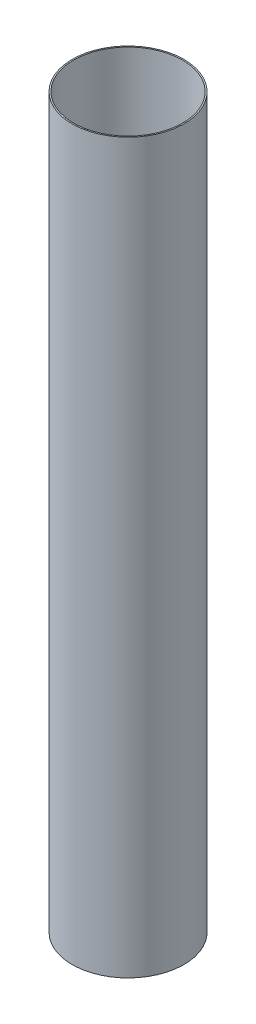
ISO-10303-21;
HEADER;
FILE_DESCRIPTION(('STEP AP214'),'2;1');
FILE_NAME('part.step','',(''),(''),'','','');
FILE_SCHEMA(('AUTOMOTIVE_DESIGN { 1 0 10303 214 1 1 1 1 }'));
ENDSEC;
DATA;
#1=APPLICATION_CONTEXT('core data for automotive mechanical design processes');
#2=APPLICATION_PROTOCOL_DEFINITION('international standard','automotive_design',2000,#1);
#3=PRODUCT_CONTEXT('',#1,'mechanical');
#4=PRODUCT('Part','Part','',(#3));
#5=PRODUCT_RELATED_PRODUCT_CATEGORY('part','',(#4));
#6=PRODUCT_DEFINITION_FORMATION('','',#4);
#7=PRODUCT_DEFINITION_CONTEXT('part definition',#1,'design');
#8=PRODUCT_DEFINITION('design','',#6,#7);
#9=PRODUCT_DEFINITION_SHAPE('','',#8);
#10=(LENGTH_UNIT() NAMED_UNIT(*) SI_UNIT(.MILLI.,.METRE.));
#11=(NAMED_UNIT(*) PLANE_ANGLE_UNIT() SI_UNIT($,.RADIAN.));
#12=(NAMED_UNIT(*) SI_UNIT($,.STERADIAN.) SOLID_ANGLE_UNIT());
#13=UNCERTAINTY_MEASURE_WITH_UNIT(LENGTH_MEASURE(1.E-05),#10,'distance_accuracy_value','');
#14=(GEOMETRIC_REPRESENTATION_CONTEXT(3) GLOBAL_UNCERTAINTY_ASSIGNED_CONTEXT((#13)) GLOBAL_UNIT_ASSIGNED_CONTEXT((#10,
#11,#12)) REPRESENTATION_CONTEXT('',''));
#15=CARTESIAN_POINT('',(0.,0.,0.));
#16=DIRECTION('',(0.,0.,1.));
#17=DIRECTION('',(1.,0.,0.));
#18=AXIS2_PLACEMENT_3D('',#15,#16,#17);
#19=CARTESIAN_POINT('',(0.,-13.97,0.));
#20=DIRECTION('',(0.,-1.,0.));
#21=DIRECTION('',(0.,0.,-1.));
#22=AXIS2_PLACEMENT_3D('',#19,#20,#21);
#23=CYLINDRICAL_SURFACE('',#22,19.0373);
#24=CARTESIAN_POINT('',(0.,0.,0.));
#25=DIRECTION('',(0.,-1.,0.));
#26=DIRECTION('',(0.,0.,-1.));
#27=AXIS2_PLACEMENT_3D('',#24,#25,#26);
#28=CIRCLE('',#27,19.0373);
#29=CARTESIAN_POINT('',(0.,0.,-19.0373));
#30=VERTEX_POINT('',#29);
#31=EDGE_CURVE('E50',#30,#30,#28,.T.);
#32=ORIENTED_EDGE('',*,*,#31,.T.);
#33=EDGE_LOOP('',(#32));
#34=FACE_BOUND('',#33,.T.);
#35=CARTESIAN_POINT('',(0.,254.,0.));
#36=DIRECTION('',(0.,-1.,0.));
#37=DIRECTION('',(0.,0.,-1.));
#38=AXIS2_PLACEMENT_3D('',#35,#36,#37);
#39=CIRCLE('',#38,19.0373);
#40=CARTESIAN_POINT('',(0.,254.,-19.0373));
#41=VERTEX_POINT('',#40);
#42=EDGE_CURVE('E10',#41,#41,#39,.T.);
#43=ORIENTED_EDGE('',*,*,#42,.F.);
#44=EDGE_LOOP('',(#43));
#45=FACE_BOUND('',#44,.T.);
#46=ADVANCED_FACE('F36',(#34,#45),#23,.F.);
#47=CARTESIAN_POINT('',(19.0373,254.,0.));
#48=DIRECTION('',(0.,1.,0.));
#49=DIRECTION('',(0.,0.,1.));
#50=AXIS2_PLACEMENT_3D('',#47,#48,#49);
#51=PLANE('',#50);
#52=ORIENTED_EDGE('',*,*,#42,.T.);
#53=EDGE_LOOP('',(#52));
#54=FACE_BOUND('',#53,.T.);
#55=CARTESIAN_POINT('',(0.,254.,0.));
#56=DIRECTION('',(0.,-1.,0.));
#57=DIRECTION('',(0.,0.,-1.));
#58=AXIS2_PLACEMENT_3D('',#55,#56,#57);
#59=CIRCLE('',#58,19.4945);
#60=CARTESIAN_POINT('',(0.,254.,-19.4945));
#61=VERTEX_POINT('',#60);
#62=EDGE_CURVE('E42',#61,#61,#59,.T.);
#63=ORIENTED_EDGE('',*,*,#62,.F.);
#64=EDGE_LOOP('',(#63));
#65=FACE_BOUND('',#64,.T.);
#66=ADVANCED_FACE('F66',(#54,#65),#51,.T.);
#67=CARTESIAN_POINT('',(0.,-13.97,0.));
#68=DIRECTION('',(0.,-1.,0.));
#69=DIRECTION('',(0.,0.,-1.));
#70=AXIS2_PLACEMENT_3D('',#67,#68,#69);
#71=CYLINDRICAL_SURFACE('',#70,19.4945);
#72=ORIENTED_EDGE('',*,*,#62,.T.);
#73=EDGE_LOOP('',(#72));
#74=FACE_BOUND('',#73,.T.);
#75=CARTESIAN_POINT('',(0.,0.,0.));
#76=DIRECTION('',(0.,-1.,0.));
#77=DIRECTION('',(0.,0.,-1.));
#78=AXIS2_PLACEMENT_3D('',#75,#76,#77);
#79=CIRCLE('',#78,19.4945);
#80=CARTESIAN_POINT('',(0.,0.,-19.4945));
#81=VERTEX_POINT('',#80);
#82=EDGE_CURVE('E46',#81,#81,#79,.T.);
#83=ORIENTED_EDGE('',*,*,#82,.F.);
#84=EDGE_LOOP('',(#83));
#85=FACE_BOUND('',#84,.T.);
#86=ADVANCED_FACE('F60',(#74,#85),#71,.T.);
#87=CARTESIAN_POINT('',(19.0373,0.,0.));
#88=DIRECTION('',(0.,-1.,0.));
#89=DIRECTION('',(0.,0.,-1.));
#90=AXIS2_PLACEMENT_3D('',#87,#88,#89);
#91=PLANE('',#90);
#92=ORIENTED_EDGE('',*,*,#82,.T.);
#93=EDGE_LOOP('',(#92));
#94=FACE_BOUND('',#93,.T.);
#95=ORIENTED_EDGE('',*,*,#31,.F.);
#96=EDGE_LOOP('',(#95));
#97=FACE_BOUND('',#96,.T.);
#98=ADVANCED_FACE('F58',(#94,#97),#91,.T.);
#99=CLOSED_SHELL('',(#46,#66,#86,#98));
#100=MANIFOLD_SOLID_BREP('B2',#99);
#101=ADVANCED_BREP_SHAPE_REPRESENTATION('',(#18,#100),#14);
#102=SHAPE_DEFINITION_REPRESENTATION(#9,#101);
ENDSEC;
END-ISO-10303-21;
